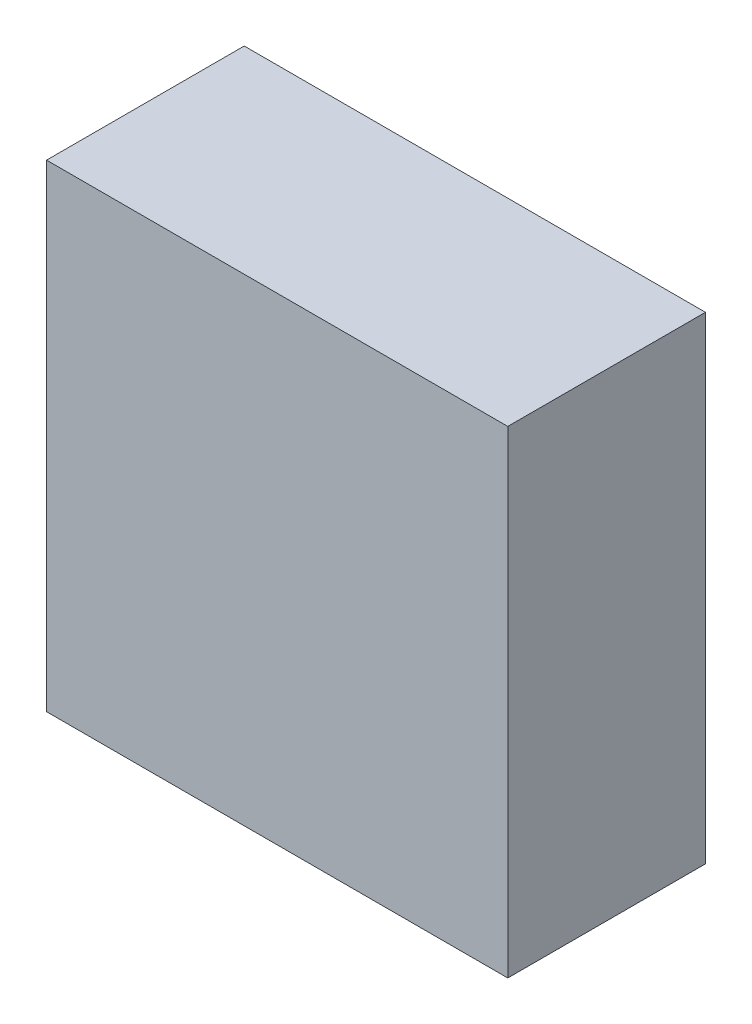
ISO-10303-21;
HEADER;
FILE_DESCRIPTION(('STEP AP214'),'2;1');
FILE_NAME('part.step','',(''),(''),'','','');
FILE_SCHEMA(('AUTOMOTIVE_DESIGN { 1 0 10303 214 1 1 1 1 }'));
ENDSEC;
DATA;
#1=APPLICATION_CONTEXT('core data for automotive mechanical design processes');
#2=APPLICATION_PROTOCOL_DEFINITION('international standard','automotive_design',2000,#1);
#3=PRODUCT_CONTEXT('',#1,'mechanical');
#4=PRODUCT('Part','Part','',(#3));
#5=PRODUCT_RELATED_PRODUCT_CATEGORY('part','',(#4));
#6=PRODUCT_DEFINITION_FORMATION('','',#4);
#7=PRODUCT_DEFINITION_CONTEXT('part definition',#1,'design');
#8=PRODUCT_DEFINITION('design','',#6,#7);
#9=PRODUCT_DEFINITION_SHAPE('','',#8);
#10=(LENGTH_UNIT() NAMED_UNIT(*) SI_UNIT(.MILLI.,.METRE.));
#11=(NAMED_UNIT(*) PLANE_ANGLE_UNIT() SI_UNIT($,.RADIAN.));
#12=(NAMED_UNIT(*) SI_UNIT($,.STERADIAN.) SOLID_ANGLE_UNIT());
#13=UNCERTAINTY_MEASURE_WITH_UNIT(LENGTH_MEASURE(1.E-05),#10,'distance_accuracy_value','');
#14=(GEOMETRIC_REPRESENTATION_CONTEXT(3) GLOBAL_UNCERTAINTY_ASSIGNED_CONTEXT((#13)) GLOBAL_UNIT_ASSIGNED_CONTEXT((#10,
#11,#12)) REPRESENTATION_CONTEXT('',''));
#15=CARTESIAN_POINT('',(0.,0.,0.));
#16=DIRECTION('',(0.,0.,1.));
#17=DIRECTION('',(1.,0.,0.));
#18=AXIS2_PLACEMENT_3D('',#15,#16,#17);
#19=CARTESIAN_POINT('',(-0.69999964062697,0.725001950933745,0.));
#20=DIRECTION('',(-1.,4.37113882867379E-08,0.));
#21=DIRECTION('',(-4.37113882867379E-08,-1.,0.));
#22=AXIS2_PLACEMENT_3D('',#19,#20,#21);
#23=PLANE('',#22);
#24=DIRECTION('',(-4.37113882930187E-08,-0.999999999999999,0.));
#25=VECTOR('',#24,1.);
#26=CARTESIAN_POINT('',(-0.69999964062697,0.725001950933745,0.));
#27=LINE('',#26,#25);
#28=CARTESIAN_POINT('',(-0.69999964062697,0.725001950933745,0.));
#29=VERTEX_POINT('',#28);
#30=CARTESIAN_POINT('',(-0.699999704009016,-0.725010256097505,0.));
#31=VERTEX_POINT('',#30);
#32=EDGE_CURVE('E11',#29,#31,#27,.T.);
#33=ORIENTED_EDGE('',*,*,#32,.T.);
#34=DIRECTION('',(0.,0.,1.));
#35=VECTOR('',#34,1.);
#36=CARTESIAN_POINT('',(-0.699999704009017,-0.725010256097505,0.));
#37=LINE('',#36,#35);
#38=CARTESIAN_POINT('',(-0.699999704009016,-0.725010256097505,0.599998772144318));
#39=VERTEX_POINT('',#38);
#40=EDGE_CURVE('E88',#31,#39,#37,.T.);
#41=ORIENTED_EDGE('',*,*,#40,.T.);
#42=DIRECTION('',(-4.37113882930187E-08,-0.999999999999999,0.));
#43=VECTOR('',#42,1.);
#44=CARTESIAN_POINT('',(-0.69999964062697,0.725001950933745,0.599998772144318));
#45=LINE('',#44,#43);
#46=CARTESIAN_POINT('',(-0.69999964062697,0.725001950933745,0.599998772144318));
#47=VERTEX_POINT('',#46);
#48=EDGE_CURVE('E83',#47,#39,#45,.T.);
#49=ORIENTED_EDGE('',*,*,#48,.F.);
#50=DIRECTION('',(0.,0.,1.));
#51=VECTOR('',#50,1.);
#52=CARTESIAN_POINT('',(-0.69999964062697,0.725001950933722,0.));
#53=LINE('',#52,#51);
#54=EDGE_CURVE('E72',#29,#47,#53,.T.);
#55=ORIENTED_EDGE('',*,*,#54,.F.);
#56=EDGE_LOOP('',(#33,#41,#49,#55));
#57=FACE_BOUND('',#56,.T.);
#58=ADVANCED_FACE('F17',(#57),#23,.T.);
#59=CARTESIAN_POINT('',(-0.699999704009016,-0.725010256097505,0.));
#60=DIRECTION('',(-4.37113882867379E-08,-1.,0.));
#61=DIRECTION('',(1.,-4.37113882867379E-08,0.));
#62=AXIS2_PLACEMENT_3D('',#59,#60,#61);
#63=PLANE('',#62);
#64=DIRECTION('',(0.999999999999999,-4.3711388257813E-08,0.));
#65=VECTOR('',#64,1.);
#66=CARTESIAN_POINT('',(-0.699999704009016,-0.725010256097505,0.));
#67=LINE('',#66,#65);
#68=CARTESIAN_POINT('',(0.70000182186989,-0.725010317293538,0.));
#69=VERTEX_POINT('',#68);
#70=EDGE_CURVE('E24',#31,#69,#67,.T.);
#71=ORIENTED_EDGE('',*,*,#70,.T.);
#72=DIRECTION('',(0.,0.,1.));
#73=VECTOR('',#72,1.);
#74=CARTESIAN_POINT('',(0.70000182186989,-0.725010317293515,0.));
#75=LINE('',#74,#73);
#76=CARTESIAN_POINT('',(0.70000182186989,-0.725010317293538,0.599998772144318));
#77=VERTEX_POINT('',#76);
#78=EDGE_CURVE('E85',#69,#77,#75,.T.);
#79=ORIENTED_EDGE('',*,*,#78,.T.);
#80=DIRECTION('',(0.999999999999999,-4.3711388257813E-08,0.));
#81=VECTOR('',#80,1.);
#82=CARTESIAN_POINT('',(-0.699999704009016,-0.725010256097505,0.599998772144318));
#83=LINE('',#82,#81);
#84=EDGE_CURVE('E66',#39,#77,#83,.T.);
#85=ORIENTED_EDGE('',*,*,#84,.F.);
#86=ORIENTED_EDGE('',*,*,#40,.F.);
#87=EDGE_LOOP('',(#71,#79,#85,#86));
#88=FACE_BOUND('',#87,.T.);
#89=ADVANCED_FACE('F89',(#88),#63,.T.);
#90=CARTESIAN_POINT('',(0.70000182186989,-0.725010317293538,0.));
#91=DIRECTION('',(1.,-4.37113882867379E-08,0.));
#92=DIRECTION('',(4.37113882867379E-08,1.,0.));
#93=AXIS2_PLACEMENT_3D('',#90,#91,#92);
#94=PLANE('',#93);
#95=DIRECTION('',(4.37113882930187E-08,0.999999999999999,0.));
#96=VECTOR('',#95,1.);
#97=CARTESIAN_POINT('',(0.70000182186989,-0.725010317293538,0.));
#98=LINE('',#97,#96);
#99=CARTESIAN_POINT('',(0.700001885251936,0.725001889737712,0.));
#100=VERTEX_POINT('',#99);
#101=EDGE_CURVE('E62',#69,#100,#98,.T.);
#102=ORIENTED_EDGE('',*,*,#101,.T.);
#103=DIRECTION('',(0.,0.,1.));
#104=VECTOR('',#103,1.);
#105=CARTESIAN_POINT('',(0.700001885251936,0.725001889737712,0.));
#106=LINE('',#105,#104);
#107=CARTESIAN_POINT('',(0.700001885251936,0.725001889737712,0.599998772144318));
#108=VERTEX_POINT('',#107);
#109=EDGE_CURVE('E55',#100,#108,#106,.T.);
#110=ORIENTED_EDGE('',*,*,#109,.T.);
#111=DIRECTION('',(4.37113882930187E-08,0.999999999999999,0.));
#112=VECTOR('',#111,1.);
#113=CARTESIAN_POINT('',(0.70000182186989,-0.725010317293538,0.599998772144318));
#114=LINE('',#113,#112);
#115=EDGE_CURVE('E59',#77,#108,#114,.T.);
#116=ORIENTED_EDGE('',*,*,#115,.F.);
#117=ORIENTED_EDGE('',*,*,#78,.F.);
#118=EDGE_LOOP('',(#102,#110,#116,#117));
#119=FACE_BOUND('',#118,.T.);
#120=ADVANCED_FACE('F57',(#119),#94,.T.);
#121=CARTESIAN_POINT('',(0.700001885251936,0.725001889737712,0.));
#122=DIRECTION('',(4.37113882867379E-08,1.,0.));
#123=DIRECTION('',(-1.,4.37113882867379E-08,0.));
#124=AXIS2_PLACEMENT_3D('',#121,#122,#123);
#125=PLANE('',#124);
#126=DIRECTION('',(-0.999999999999999,4.3711388257813E-08,0.));
#127=VECTOR('',#126,1.);
#128=CARTESIAN_POINT('',(0.700001885251936,0.725001889737712,0.));
#129=LINE('',#128,#127);
#130=EDGE_CURVE('E65',#100,#29,#129,.T.);
#131=ORIENTED_EDGE('',*,*,#130,.T.);
#132=ORIENTED_EDGE('',*,*,#54,.T.);
#133=DIRECTION('',(-0.999999999999999,4.3711388257813E-08,0.));
#134=VECTOR('',#133,1.);
#135=CARTESIAN_POINT('',(0.700001885251936,0.725001889737712,0.599998772144318));
#136=LINE('',#135,#134);
#137=EDGE_CURVE('E70',#108,#47,#136,.T.);
#138=ORIENTED_EDGE('',*,*,#137,.F.);
#139=ORIENTED_EDGE('',*,*,#109,.F.);
#140=EDGE_LOOP('',(#131,#132,#138,#139));
#141=FACE_BOUND('',#140,.T.);
#142=ADVANCED_FACE('F71',(#141),#125,.T.);
#143=CARTESIAN_POINT('',(-95.6999816894531,411.399993896484,0.599998772144318));
#144=DIRECTION('',(0.,0.,1.));
#145=DIRECTION('',(-4.37113882867379E-08,-1.,0.));
#146=AXIS2_PLACEMENT_3D('',#143,#144,#145);
#147=PLANE('',#146);
#148=ORIENTED_EDGE('',*,*,#48,.T.);
#149=ORIENTED_EDGE('',*,*,#84,.T.);
#150=ORIENTED_EDGE('',*,*,#115,.T.);
#151=ORIENTED_EDGE('',*,*,#137,.T.);
#152=EDGE_LOOP('',(#148,#149,#150,#151));
#153=FACE_BOUND('',#152,.T.);
#154=ADVANCED_FACE('F76',(#153),#147,.T.);
#155=CARTESIAN_POINT('',(-95.6999816894531,411.399993896484,0.));
#156=DIRECTION('',(0.,0.,1.));
#157=DIRECTION('',(-4.37113882867379E-08,-1.,0.));
#158=AXIS2_PLACEMENT_3D('',#155,#156,#157);
#159=PLANE('',#158);
#160=ORIENTED_EDGE('',*,*,#130,.F.);
#161=ORIENTED_EDGE('',*,*,#101,.F.);
#162=ORIENTED_EDGE('',*,*,#70,.F.);
#163=ORIENTED_EDGE('',*,*,#32,.F.);
#164=EDGE_LOOP('',(#160,#161,#162,#163));
#165=FACE_BOUND('',#164,.T.);
#166=ADVANCED_FACE('F91',(#165),#159,.F.);
#167=CLOSED_SHELL('',(#58,#89,#120,#142,#154,#166));
#168=MANIFOLD_SOLID_BREP('B1',#167);
#169=ADVANCED_BREP_SHAPE_REPRESENTATION('',(#18,#168),#14);
#170=SHAPE_DEFINITION_REPRESENTATION(#9,#169);
ENDSEC;
END-ISO-10303-21;
